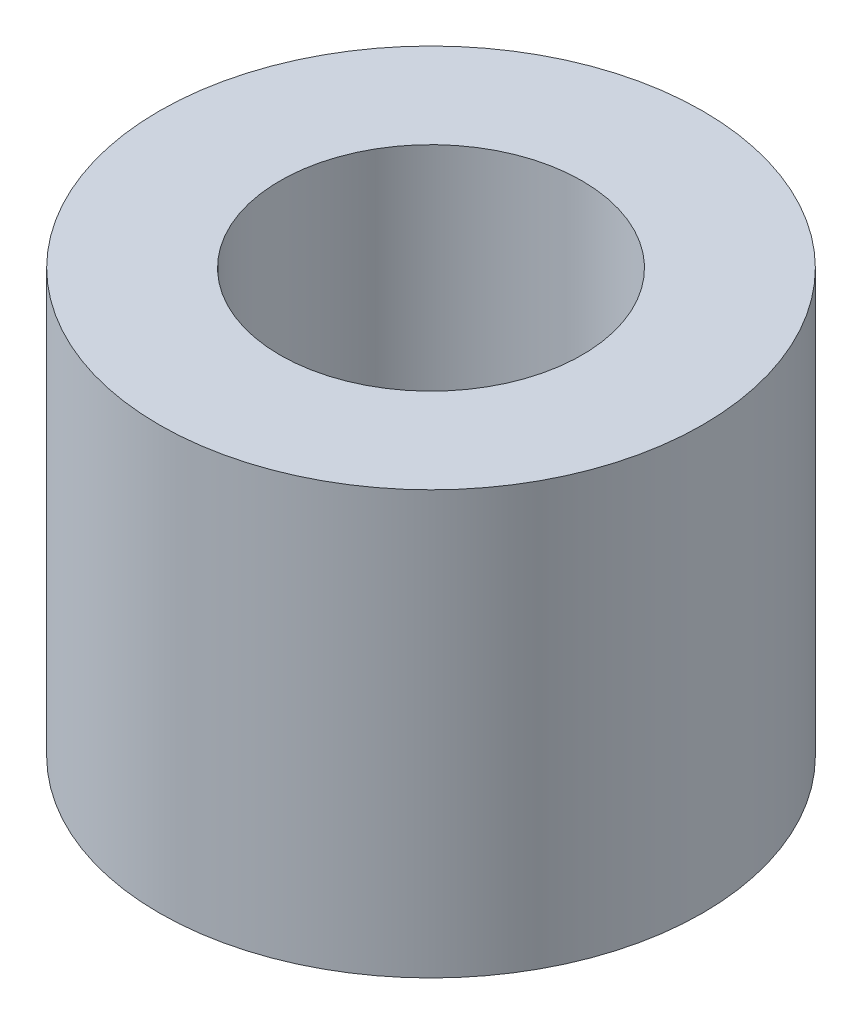
ISO-10303-21;
HEADER;
FILE_DESCRIPTION(('STEP AP214'),'2;1');
FILE_NAME('part.step','',(''),(''),'','','');
FILE_SCHEMA(('AUTOMOTIVE_DESIGN { 1 0 10303 214 1 1 1 1 }'));
ENDSEC;
DATA;
#1=APPLICATION_CONTEXT('core data for automotive mechanical design processes');
#2=APPLICATION_PROTOCOL_DEFINITION('international standard','automotive_design',2000,#1);
#3=PRODUCT_CONTEXT('',#1,'mechanical');
#4=PRODUCT('Part','Part','',(#3));
#5=PRODUCT_RELATED_PRODUCT_CATEGORY('part','',(#4));
#6=PRODUCT_DEFINITION_FORMATION('','',#4);
#7=PRODUCT_DEFINITION_CONTEXT('part definition',#1,'design');
#8=PRODUCT_DEFINITION('design','',#6,#7);
#9=PRODUCT_DEFINITION_SHAPE('','',#8);
#10=(LENGTH_UNIT() NAMED_UNIT(*) SI_UNIT(.MILLI.,.METRE.));
#11=(NAMED_UNIT(*) PLANE_ANGLE_UNIT() SI_UNIT($,.RADIAN.));
#12=(NAMED_UNIT(*) SI_UNIT($,.STERADIAN.) SOLID_ANGLE_UNIT());
#13=UNCERTAINTY_MEASURE_WITH_UNIT(LENGTH_MEASURE(1.E-05),#10,'distance_accuracy_value','');
#14=(GEOMETRIC_REPRESENTATION_CONTEXT(3) GLOBAL_UNCERTAINTY_ASSIGNED_CONTEXT((#13)) GLOBAL_UNIT_ASSIGNED_CONTEXT((#10,
#11,#12)) REPRESENTATION_CONTEXT('',''));
#15=CARTESIAN_POINT('',(0.,0.,0.));
#16=DIRECTION('',(0.,0.,1.));
#17=DIRECTION('',(1.,0.,0.));
#18=AXIS2_PLACEMENT_3D('',#15,#16,#17);
#19=CARTESIAN_POINT('',(0.,7.,0.));
#20=DIRECTION('',(0.,1.,0.));
#21=DIRECTION('',(0.,0.,1.));
#22=AXIS2_PLACEMENT_3D('',#19,#20,#21);
#23=PLANE('',#22);
#24=CARTESIAN_POINT('',(0.,7.,0.));
#25=DIRECTION('',(0.,1.,0.));
#26=DIRECTION('',(0.,0.,1.));
#27=AXIS2_PLACEMENT_3D('',#24,#25,#26);
#28=CIRCLE('',#27,4.5);
#29=CARTESIAN_POINT('',(0.,7.,4.5));
#30=VERTEX_POINT('',#29);
#31=EDGE_CURVE('E10',#30,#30,#28,.T.);
#32=ORIENTED_EDGE('',*,*,#31,.T.);
#33=EDGE_LOOP('',(#32));
#34=FACE_BOUND('',#33,.T.);
#35=CARTESIAN_POINT('',(0.,7.,0.));
#36=DIRECTION('',(0.,1.,0.));
#37=DIRECTION('',(0.,0.,1.));
#38=AXIS2_PLACEMENT_3D('',#35,#36,#37);
#39=CIRCLE('',#38,2.5);
#40=CARTESIAN_POINT('',(0.,7.,2.5));
#41=VERTEX_POINT('',#40);
#42=EDGE_CURVE('E43',#41,#41,#39,.T.);
#43=ORIENTED_EDGE('',*,*,#42,.F.);
#44=EDGE_LOOP('',(#43));
#45=FACE_BOUND('',#44,.T.);
#46=ADVANCED_FACE('F32',(#34,#45),#23,.T.);
#47=CARTESIAN_POINT('',(0.,0.,0.));
#48=DIRECTION('',(0.,1.,0.));
#49=DIRECTION('',(0.,0.,1.));
#50=AXIS2_PLACEMENT_3D('',#47,#48,#49);
#51=PLANE('',#50);
#52=CARTESIAN_POINT('',(0.,0.,0.));
#53=DIRECTION('',(0.,1.,0.));
#54=DIRECTION('',(0.,0.,1.));
#55=AXIS2_PLACEMENT_3D('',#52,#53,#54);
#56=CIRCLE('',#55,4.5);
#57=CARTESIAN_POINT('',(0.,0.,4.5));
#58=VERTEX_POINT('',#57);
#59=EDGE_CURVE('E36',#58,#58,#56,.T.);
#60=ORIENTED_EDGE('',*,*,#59,.F.);
#61=EDGE_LOOP('',(#60));
#62=FACE_BOUND('',#61,.T.);
#63=CARTESIAN_POINT('',(0.,0.,0.));
#64=DIRECTION('',(0.,1.,0.));
#65=DIRECTION('',(0.,0.,1.));
#66=AXIS2_PLACEMENT_3D('',#63,#64,#65);
#67=CIRCLE('',#66,2.5);
#68=CARTESIAN_POINT('',(0.,0.,2.5));
#69=VERTEX_POINT('',#68);
#70=EDGE_CURVE('E45',#69,#69,#67,.T.);
#71=ORIENTED_EDGE('',*,*,#70,.T.);
#72=EDGE_LOOP('',(#71));
#73=FACE_BOUND('',#72,.T.);
#74=ADVANCED_FACE('F55',(#62,#73),#51,.F.);
#75=CARTESIAN_POINT('',(0.,7.,0.));
#76=DIRECTION('',(0.,-1.,0.));
#77=DIRECTION('',(0.,0.,-1.));
#78=AXIS2_PLACEMENT_3D('',#75,#76,#77);
#79=CYLINDRICAL_SURFACE('',#78,4.5);
#80=ORIENTED_EDGE('',*,*,#31,.F.);
#81=EDGE_LOOP('',(#80));
#82=FACE_BOUND('',#81,.T.);
#83=ORIENTED_EDGE('',*,*,#59,.T.);
#84=EDGE_LOOP('',(#83));
#85=FACE_BOUND('',#84,.T.);
#86=ADVANCED_FACE('F34',(#82,#85),#79,.T.);
#87=CARTESIAN_POINT('',(0.,7.,0.));
#88=DIRECTION('',(0.,-1.,0.));
#89=DIRECTION('',(0.,0.,-1.));
#90=AXIS2_PLACEMENT_3D('',#87,#88,#89);
#91=CYLINDRICAL_SURFACE('',#90,2.5);
#92=ORIENTED_EDGE('',*,*,#42,.T.);
#93=EDGE_LOOP('',(#92));
#94=FACE_BOUND('',#93,.T.);
#95=ORIENTED_EDGE('',*,*,#70,.F.);
#96=EDGE_LOOP('',(#95));
#97=FACE_BOUND('',#96,.T.);
#98=ADVANCED_FACE('F51',(#94,#97),#91,.F.);
#99=CLOSED_SHELL('',(#46,#74,#86,#98));
#100=MANIFOLD_SOLID_BREP('B2',#99);
#101=ADVANCED_BREP_SHAPE_REPRESENTATION('',(#18,#100),#14);
#102=SHAPE_DEFINITION_REPRESENTATION(#9,#101);
ENDSEC;
END-ISO-10303-21;
